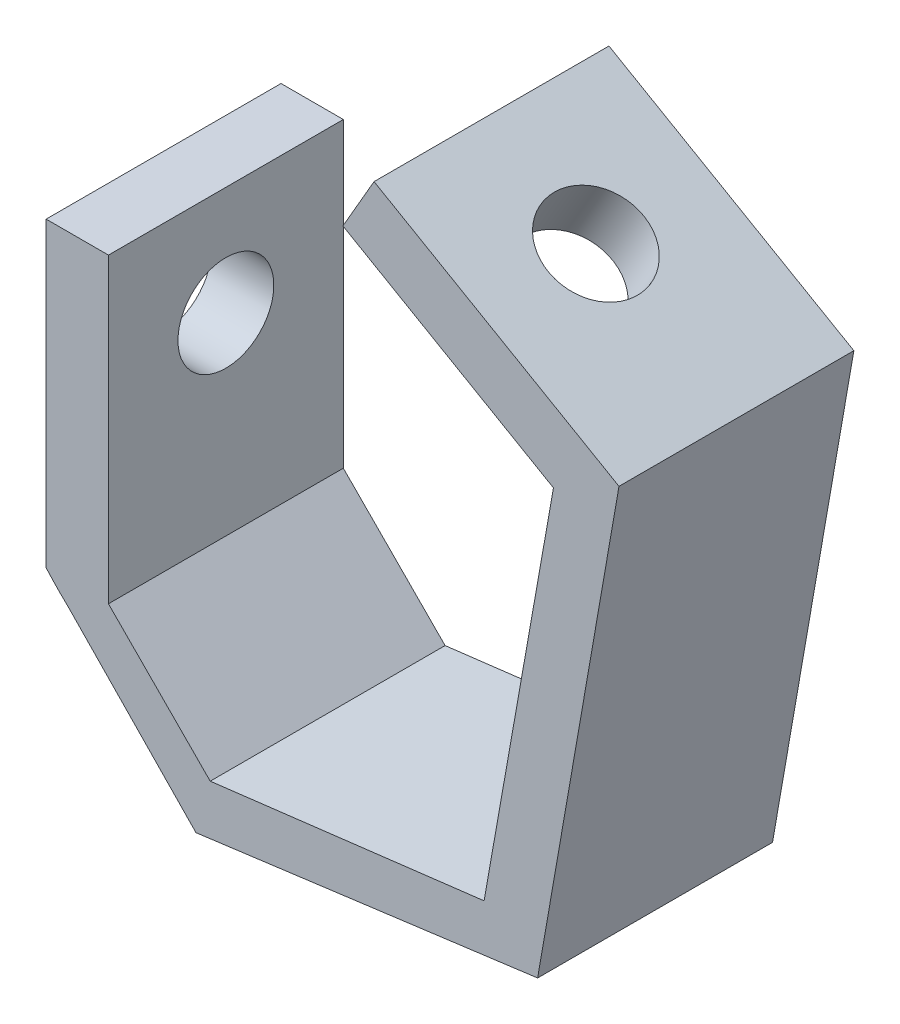
ISO-10303-21;
HEADER;
FILE_DESCRIPTION(('STEP AP214'),'2;1');
FILE_NAME('part.step','',(''),(''),'','','');
FILE_SCHEMA(('AUTOMOTIVE_DESIGN { 1 0 10303 214 1 1 1 1 }'));
ENDSEC;
DATA;
#1=APPLICATION_CONTEXT('core data for automotive mechanical design processes');
#2=APPLICATION_PROTOCOL_DEFINITION('international standard','automotive_design',2000,#1);
#3=PRODUCT_CONTEXT('',#1,'mechanical');
#4=PRODUCT('Part','Part','',(#3));
#5=PRODUCT_RELATED_PRODUCT_CATEGORY('part','',(#4));
#6=PRODUCT_DEFINITION_FORMATION('','',#4);
#7=PRODUCT_DEFINITION_CONTEXT('part definition',#1,'design');
#8=PRODUCT_DEFINITION('design','',#6,#7);
#9=PRODUCT_DEFINITION_SHAPE('','',#8);
#10=(LENGTH_UNIT() NAMED_UNIT(*) SI_UNIT(.MILLI.,.METRE.));
#11=(NAMED_UNIT(*) PLANE_ANGLE_UNIT() SI_UNIT($,.RADIAN.));
#12=(NAMED_UNIT(*) SI_UNIT($,.STERADIAN.) SOLID_ANGLE_UNIT());
#13=UNCERTAINTY_MEASURE_WITH_UNIT(LENGTH_MEASURE(1.E-05),#10,'distance_accuracy_value','');
#14=(GEOMETRIC_REPRESENTATION_CONTEXT(3) GLOBAL_UNCERTAINTY_ASSIGNED_CONTEXT((#13)) GLOBAL_UNIT_ASSIGNED_CONTEXT((#10,
#11,#12)) REPRESENTATION_CONTEXT('',''));
#15=CARTESIAN_POINT('',(0.,0.,0.));
#16=DIRECTION('',(0.,0.,1.));
#17=DIRECTION('',(1.,0.,0.));
#18=AXIS2_PLACEMENT_3D('',#15,#16,#17);
#19=CARTESIAN_POINT('',(3.62139958278742,-29.7599826456849,-284.));
#20=DIRECTION('',(0.120795817451497,-0.992677374823374,0.));
#21=DIRECTION('',(0.992677374823374,0.120795817451497,0.));
#22=AXIS2_PLACEMENT_3D('',#19,#20,#21);
#23=PLANE('',#22);
#24=DIRECTION('',(0.992677374823374,0.120795817451497,0.));
#25=VECTOR('',#24,1.);
#26=CARTESIAN_POINT('',(3.62139958278742,-29.7599826456849,0.));
#27=LINE('',#26,#25);
#28=CARTESIAN_POINT('',(-34.7689106346283,-34.4315799063301,0.));
#29=VERTEX_POINT('',#28);
#30=CARTESIAN_POINT('',(22.3631271349745,-27.4793602022425,0.));
#31=VERTEX_POINT('',#30);
#32=EDGE_CURVE('E164',#29,#31,#27,.T.);
#33=ORIENTED_EDGE('',*,*,#32,.F.);
#34=DIRECTION('',(0.,0.,-1.));
#35=VECTOR('',#34,1.);
#36=CARTESIAN_POINT('',(-34.7689106346283,-34.4315799063301,284.));
#37=LINE('',#36,#35);
#38=CARTESIAN_POINT('',(-34.7689106346283,-34.4315799063301,49.));
#39=VERTEX_POINT('',#38);
#40=EDGE_CURVE('E191',#39,#29,#37,.T.);
#41=ORIENTED_EDGE('',*,*,#40,.F.);
#42=DIRECTION('',(-0.992677374823374,-0.120795817451497,0.));
#43=VECTOR('',#42,1.);
#44=CARTESIAN_POINT('',(3.62139958278741,-29.7599826456849,49.));
#45=LINE('',#44,#43);
#46=CARTESIAN_POINT('',(22.3631271349745,-27.4793602022425,49.));
#47=VERTEX_POINT('',#46);
#48=EDGE_CURVE('E195',#47,#39,#45,.T.);
#49=ORIENTED_EDGE('',*,*,#48,.F.);
#50=DIRECTION('',(0.,0.,1.));
#51=VECTOR('',#50,1.);
#52=CARTESIAN_POINT('',(22.3631271349745,-27.4793602022425,-284.));
#53=LINE('',#52,#51);
#54=EDGE_CURVE('E163',#31,#47,#53,.T.);
#55=ORIENTED_EDGE('',*,*,#54,.F.);
#56=EDGE_LOOP('',(#33,#41,#49,#55));
#57=FACE_BOUND('',#56,.T.);
#58=ADVANCED_FACE('F42',(#57),#23,.F.);
#59=CARTESIAN_POINT('',(26.3980561235689,-4.66970064217994,-284.));
#60=DIRECTION('',(0.984711846020968,-0.174191217648818,0.));
#61=DIRECTION('',(0.174191217648818,0.984711846020968,0.));
#62=AXIS2_PLACEMENT_3D('',#59,#60,#61);
#63=PLANE('',#62);
#64=DIRECTION('',(0.174191217648818,0.984711846020968,0.));
#65=VECTOR('',#64,1.);
#66=CARTESIAN_POINT('',(26.3980561235689,-4.66970064217994,0.));
#67=LINE('',#66,#65);
#68=CARTESIAN_POINT('',(36.8406677231111,54.3629158367772,0.));
#69=VERTEX_POINT('',#68);
#70=EDGE_CURVE('E176',#31,#69,#67,.T.);
#71=ORIENTED_EDGE('',*,*,#70,.F.);
#72=ORIENTED_EDGE('',*,*,#54,.T.);
#73=DIRECTION('',(-0.174191217648818,-0.984711846020968,0.));
#74=VECTOR('',#73,1.);
#75=CARTESIAN_POINT('',(26.3980561235689,-4.66970064217994,49.));
#76=LINE('',#75,#74);
#77=CARTESIAN_POINT('',(36.8406677231111,54.3629158367772,49.));
#78=VERTEX_POINT('',#77);
#79=EDGE_CURVE('E151',#78,#47,#76,.T.);
#80=ORIENTED_EDGE('',*,*,#79,.F.);
#81=DIRECTION('',(0.,0.,1.));
#82=VECTOR('',#81,1.);
#83=CARTESIAN_POINT('',(36.8406677231111,54.3629158367772,-24.));
#84=LINE('',#83,#82);
#85=EDGE_CURVE('E161',#69,#78,#84,.T.);
#86=ORIENTED_EDGE('',*,*,#85,.F.);
#87=EDGE_LOOP('',(#71,#72,#80,#86));
#88=FACE_BOUND('',#87,.T.);
#89=ADVANCED_FACE('F160',(#88),#63,.F.);
#90=CARTESIAN_POINT('',(38.6119590248385,-6.73358585158545,-284.));
#91=DIRECTION('',(0.985132132549683,-0.171798374317437,0.));
#92=DIRECTION('',(0.171798374317437,0.985132132549683,0.));
#93=AXIS2_PLACEMENT_3D('',#90,#91,#92);
#94=PLANE('',#93);
#95=DIRECTION('',(0.,0.,1.));
#96=VECTOR('',#95,1.);
#97=CARTESIAN_POINT('',(33.535950770208,-35.8406065471613,-284.));
#98=LINE('',#97,#96);
#99=CARTESIAN_POINT('',(33.535950770208,-35.8406065471613,0.));
#100=VERTEX_POINT('',#99);
#101=CARTESIAN_POINT('',(33.535950770208,-35.8406065471613,49.));
#102=VERTEX_POINT('',#101);
#103=EDGE_CURVE('E205',#100,#102,#98,.T.);
#104=ORIENTED_EDGE('',*,*,#103,.F.);
#105=DIRECTION('',(0.171798374317437,0.985132132549683,0.));
#106=VECTOR('',#105,1.);
#107=CARTESIAN_POINT('',(37.4133421031573,-13.606736129388,0.));
#108=LINE('',#107,#106);
#109=CARTESIAN_POINT('',(50.5083302491978,61.4829941970784,0.));
#110=VERTEX_POINT('',#109);
#111=EDGE_CURVE('E187',#100,#110,#108,.T.);
#112=ORIENTED_EDGE('',*,*,#111,.T.);
#113=DIRECTION('',(0.,0.,-1.));
#114=VECTOR('',#113,1.);
#115=CARTESIAN_POINT('',(50.5083302491978,61.4829941970784,49.));
#116=LINE('',#115,#114);
#117=CARTESIAN_POINT('',(50.5083302491978,61.4829941970784,49.));
#118=VERTEX_POINT('',#117);
#119=EDGE_CURVE('E228',#118,#110,#116,.T.);
#120=ORIENTED_EDGE('',*,*,#119,.F.);
#121=DIRECTION('',(-0.171798374317437,-0.985132132549683,0.));
#122=VECTOR('',#121,1.);
#123=CARTESIAN_POINT('',(38.6119590248385,-6.73358585158544,49.));
#124=LINE('',#123,#122);
#125=EDGE_CURVE('E200',#118,#102,#124,.T.);
#126=ORIENTED_EDGE('',*,*,#125,.T.);
#127=EDGE_LOOP('',(#104,#112,#120,#126));
#128=FACE_BOUND('',#127,.T.);
#129=ADVANCED_FACE('F285',(#128),#94,.T.);
#130=CARTESIAN_POINT('',(5.21023157686451,-39.5702646129378,-284.));
#131=DIRECTION('',(0.130543614567205,-0.991442567522562,0.));
#132=DIRECTION('',(0.991442567522562,0.130543614567205,0.));
#133=AXIS2_PLACEMENT_3D('',#130,#131,#132);
#134=PLANE('',#133);
#135=DIRECTION('',(0.,0.,1.));
#136=VECTOR('',#135,1.);
#137=CARTESIAN_POINT('',(-37.7388538397128,-45.2253867917705,-284.));
#138=LINE('',#137,#136);
#139=CARTESIAN_POINT('',(-37.7388538397128,-45.2253867917705,0.));
#140=VERTEX_POINT('',#139);
#141=CARTESIAN_POINT('',(-37.7388538397128,-45.2253867917705,49.));
#142=VERTEX_POINT('',#141);
#143=EDGE_CURVE('E202',#140,#142,#138,.T.);
#144=ORIENTED_EDGE('',*,*,#143,.F.);
#145=DIRECTION('',(0.991442567522562,0.130543614567205,0.));
#146=VECTOR('',#145,1.);
#147=CARTESIAN_POINT('',(5.21023157686451,-39.5702646129378,0.));
#148=LINE('',#147,#146);
#149=EDGE_CURVE('E181',#140,#100,#148,.T.);
#150=ORIENTED_EDGE('',*,*,#149,.T.);
#151=ORIENTED_EDGE('',*,*,#103,.T.);
#152=DIRECTION('',(-0.991442567522562,-0.130543614567205,0.));
#153=VECTOR('',#152,1.);
#154=CARTESIAN_POINT('',(5.21023157686451,-39.5702646129378,49.));
#155=LINE('',#154,#153);
#156=EDGE_CURVE('E165',#102,#142,#155,.T.);
#157=ORIENTED_EDGE('',*,*,#156,.T.);
#158=EDGE_LOOP('',(#144,#150,#151,#157));
#159=FACE_BOUND('',#158,.T.);
#160=ADVANCED_FACE('F282',(#159),#134,.T.);
#161=CARTESIAN_POINT('',(-42.0447399681987,-40.7866869034071,-284.));
#162=DIRECTION('',(-0.717763617184966,-0.696286858877542,0.));
#163=DIRECTION('',(0.696286858877542,-0.717763617184966,0.));
#164=AXIS2_PLACEMENT_3D('',#161,#162,#163);
#165=PLANE('',#164);
#166=DIRECTION('',(0.,0.,-1.));
#167=VECTOR('',#166,1.);
#168=CARTESIAN_POINT('',(-64.4354967725427,-17.7052939538077,154.));
#169=LINE('',#168,#167);
#170=CARTESIAN_POINT('',(-64.4354967725427,-17.7052939538077,49.));
#171=VERTEX_POINT('',#170);
#172=CARTESIAN_POINT('',(-64.4354967725427,-17.7052939538077,0.));
#173=VERTEX_POINT('',#172);
#174=EDGE_CURVE('E184',#171,#173,#169,.T.);
#175=ORIENTED_EDGE('',*,*,#174,.T.);
#176=DIRECTION('',(0.696286858877542,-0.717763617184966,0.));
#177=VECTOR('',#176,1.);
#178=CARTESIAN_POINT('',(-42.0447399681987,-40.7866869034071,0.));
#179=LINE('',#178,#177);
#180=EDGE_CURVE('E178',#173,#140,#179,.T.);
#181=ORIENTED_EDGE('',*,*,#180,.T.);
#182=ORIENTED_EDGE('',*,*,#143,.T.);
#183=DIRECTION('',(-0.696286858877542,0.717763617184966,0.));
#184=VECTOR('',#183,1.);
#185=CARTESIAN_POINT('',(-42.0447399681987,-40.7866869034071,49.));
#186=LINE('',#185,#184);
#187=EDGE_CURVE('E169',#142,#171,#186,.T.);
#188=ORIENTED_EDGE('',*,*,#187,.T.);
#189=EDGE_LOOP('',(#175,#181,#182,#188));
#190=FACE_BOUND('',#189,.T.);
#191=ADVANCED_FACE('F278',(#190),#165,.T.);
#192=CARTESIAN_POINT('',(-15.5218442790721,34.311385031299,-9.00000000000001));
#193=DIRECTION('',(0.,0.,1.));
#194=DIRECTION('',(1.,0.,0.));
#195=AXIS2_PLACEMENT_3D('',#192,#193,#194);
#196=CYLINDRICAL_SURFACE('',#195,71.4022429121918);
#197=CARTESIAN_POINT('',(-15.5218442790721,34.311385031299,0.));
#198=DIRECTION('',(0.,0.,1.));
#199=DIRECTION('',(1.,0.,0.));
#200=AXIS2_PLACEMENT_3D('',#197,#198,#199);
#201=CIRCLE('',#200,71.4022429121918);
#202=CARTESIAN_POINT('',(-69.,-13.,0.));
#203=VERTEX_POINT('',#202);
#204=EDGE_CURVE('E209',#173,#203,#201,.F.);
#205=ORIENTED_EDGE('',*,*,#204,.F.);
#206=ORIENTED_EDGE('',*,*,#174,.F.);
#207=CARTESIAN_POINT('',(-15.5218442790721,34.311385031299,49.));
#208=DIRECTION('',(0.,0.,1.));
#209=DIRECTION('',(1.,0.,0.));
#210=AXIS2_PLACEMENT_3D('',#207,#208,#209);
#211=CIRCLE('',#210,71.4022429121918);
#212=CARTESIAN_POINT('',(-69.,-13.,49.));
#213=VERTEX_POINT('',#212);
#214=EDGE_CURVE('E211',#213,#171,#211,.T.);
#215=ORIENTED_EDGE('',*,*,#214,.F.);
#216=DIRECTION('',(0.,0.,-1.));
#217=VECTOR('',#216,1.);
#218=CARTESIAN_POINT('',(-69.,-13.,49.));
#219=LINE('',#218,#217);
#220=EDGE_CURVE('E242',#213,#203,#219,.T.);
#221=ORIENTED_EDGE('',*,*,#220,.T.);
#222=EDGE_LOOP('',(#205,#206,#215,#221));
#223=FACE_BOUND('',#222,.T.);
#224=ADVANCED_FACE('F276',(#223),#196,.T.);
#225=CARTESIAN_POINT('',(39.25,67.9829941970784,49.));
#226=DIRECTION('',(-0.5,-0.866025403784438,0.));
#227=DIRECTION('',(0.866025403784439,-0.5,0.));
#228=AXIS2_PLACEMENT_3D('',#225,#226,#227);
#229=PLANE('',#228);
#230=DIRECTION('',(-0.866025403784438,0.5,0.));
#231=VECTOR('',#230,1.);
#232=CARTESIAN_POINT('',(39.25,67.9829941970784,0.));
#233=LINE('',#232,#231);
#234=CARTESIAN_POINT('',(-0.587168574084113,90.9829941970784,0.));
#235=VERTEX_POINT('',#234);
#236=EDGE_CURVE('E218',#110,#235,#233,.T.);
#237=ORIENTED_EDGE('',*,*,#236,.T.);
#238=DIRECTION('',(0.,0.,-1.));
#239=VECTOR('',#238,1.);
#240=CARTESIAN_POINT('',(-0.587168574084113,90.9829941970784,49.));
#241=LINE('',#240,#239);
#242=CARTESIAN_POINT('',(-0.587168574084113,90.9829941970784,49.));
#243=VERTEX_POINT('',#242);
#244=EDGE_CURVE('E251',#243,#235,#241,.T.);
#245=ORIENTED_EDGE('',*,*,#244,.F.);
#246=DIRECTION('',(-0.866025403784438,0.5,0.));
#247=VECTOR('',#246,1.);
#248=CARTESIAN_POINT('',(39.25,67.9829941970784,49.));
#249=LINE('',#248,#247);
#250=EDGE_CURVE('E93',#118,#243,#249,.T.);
#251=ORIENTED_EDGE('',*,*,#250,.F.);
#252=ORIENTED_EDGE('',*,*,#119,.T.);
#253=EDGE_LOOP('',(#237,#245,#251,#252));
#254=FACE_BOUND('',#253,.T.);
#255=CARTESIAN_POINT('',(21.1933703310945,78.4079941970784,24.5));
#256=DIRECTION('',(0.5,0.866025403784439,0.));
#257=DIRECTION('',(-0.866025403784439,0.5,0.));
#258=AXIS2_PLACEMENT_3D('',#255,#256,#257);
#259=CIRCLE('',#258,9.99999999999999);
#260=CARTESIAN_POINT('',(12.5331162932501,83.4079941970784,24.5));
#261=VERTEX_POINT('',#260);
#262=EDGE_CURVE('E214',#261,#261,#259,.T.);
#263=ORIENTED_EDGE('',*,*,#262,.F.);
#264=EDGE_LOOP('',(#263));
#265=FACE_BOUND('',#264,.T.);
#266=ADVANCED_FACE('F44',(#254,#265),#229,.F.);
#267=CARTESIAN_POINT('',(-39.8371685740841,23.,49.));
#268=DIRECTION('',(-0.866025403784438,0.5,0.));
#269=DIRECTION('',(-0.5,-0.866025403784439,0.));
#270=AXIS2_PLACEMENT_3D('',#267,#268,#269);
#271=PLANE('',#270);
#272=DIRECTION('',(0.5,0.866025403784438,0.));
#273=VECTOR('',#272,1.);
#274=CARTESIAN_POINT('',(-39.8371685740841,23.,0.));
#275=LINE('',#274,#273);
#276=CARTESIAN_POINT('',(-7.08716857408409,79.7246639478807,0.));
#277=VERTEX_POINT('',#276);
#278=EDGE_CURVE('E231',#277,#235,#275,.T.);
#279=ORIENTED_EDGE('',*,*,#278,.F.);
#280=DIRECTION('',(0.,0.,-1.));
#281=VECTOR('',#280,1.);
#282=CARTESIAN_POINT('',(-7.08716857408409,79.7246639478807,49.));
#283=LINE('',#282,#281);
#284=CARTESIAN_POINT('',(-7.08716857408409,79.7246639478807,49.));
#285=VERTEX_POINT('',#284);
#286=EDGE_CURVE('E249',#285,#277,#283,.T.);
#287=ORIENTED_EDGE('',*,*,#286,.F.);
#288=DIRECTION('',(0.5,0.866025403784438,0.));
#289=VECTOR('',#288,1.);
#290=CARTESIAN_POINT('',(-39.8371685740841,23.,49.));
#291=LINE('',#290,#289);
#292=EDGE_CURVE('E154',#285,#243,#291,.T.);
#293=ORIENTED_EDGE('',*,*,#292,.T.);
#294=ORIENTED_EDGE('',*,*,#244,.T.);
#295=EDGE_LOOP('',(#279,#287,#293,#294));
#296=FACE_BOUND('',#295,.T.);
#297=ADVANCED_FACE('F291',(#296),#271,.T.);
#298=CARTESIAN_POINT('',(32.7499999999998,56.7246639478808,49.));
#299=DIRECTION('',(-0.499999999999998,-0.86602540378444,0.));
#300=DIRECTION('',(0.86602540378444,-0.499999999999998,0.));
#301=AXIS2_PLACEMENT_3D('',#298,#299,#300);
#302=PLANE('',#301);
#303=DIRECTION('',(-0.86602540378444,0.499999999999998,0.));
#304=VECTOR('',#303,1.);
#305=CARTESIAN_POINT('',(32.7499999999998,56.7246639478808,0.));
#306=LINE('',#305,#304);
#307=EDGE_CURVE('E57',#69,#277,#306,.T.);
#308=ORIENTED_EDGE('',*,*,#307,.F.);
#309=ORIENTED_EDGE('',*,*,#85,.T.);
#310=DIRECTION('',(-0.86602540378444,0.499999999999998,0.));
#311=VECTOR('',#310,1.);
#312=CARTESIAN_POINT('',(32.7499999999998,56.7246639478808,49.));
#313=LINE('',#312,#311);
#314=EDGE_CURVE('E147',#78,#285,#313,.T.);
#315=ORIENTED_EDGE('',*,*,#314,.T.);
#316=ORIENTED_EDGE('',*,*,#286,.T.);
#317=EDGE_LOOP('',(#308,#309,#315,#316));
#318=FACE_BOUND('',#317,.T.);
#319=CARTESIAN_POINT('',(14.6933703310945,67.1496639478807,24.5));
#320=DIRECTION('',(0.5,0.866025403784439,0.));
#321=DIRECTION('',(-0.866025403784439,0.5,0.));
#322=AXIS2_PLACEMENT_3D('',#319,#320,#321);
#323=CIRCLE('',#322,9.99999999999999);
#324=CARTESIAN_POINT('',(6.03311629325014,72.1496639478807,24.5));
#325=VERTEX_POINT('',#324);
#326=EDGE_CURVE('E215',#325,#325,#323,.T.);
#327=ORIENTED_EDGE('',*,*,#326,.T.);
#328=EDGE_LOOP('',(#327));
#329=FACE_BOUND('',#328,.T.);
#330=ADVANCED_FACE('F167',(#318,#329),#302,.T.);
#331=CARTESIAN_POINT('',(-56.,0.,49.));
#332=DIRECTION('',(-1.,0.,0.));
#333=DIRECTION('',(0.,0.,1.));
#334=AXIS2_PLACEMENT_3D('',#331,#332,#333);
#335=PLANE('',#334);
#336=CARTESIAN_POINT('',(-56.,27.31,24.5));
#337=DIRECTION('',(-1.,0.,0.));
#338=DIRECTION('',(0.,0.,1.));
#339=AXIS2_PLACEMENT_3D('',#336,#337,#338);
#340=CIRCLE('',#339,10.);
#341=CARTESIAN_POINT('',(-56.,27.31,34.5));
#342=VERTEX_POINT('',#341);
#343=EDGE_CURVE('E50',#342,#342,#340,.F.);
#344=ORIENTED_EDGE('',*,*,#343,.F.);
#345=EDGE_LOOP('',(#344));
#346=FACE_BOUND('',#345,.T.);
#347=DIRECTION('',(0.,0.,-1.));
#348=VECTOR('',#347,1.);
#349=CARTESIAN_POINT('',(-56.,50.,49.));
#350=LINE('',#349,#348);
#351=CARTESIAN_POINT('',(-56.,50.,49.));
#352=VERTEX_POINT('',#351);
#353=CARTESIAN_POINT('',(-56.,50.,0.));
#354=VERTEX_POINT('',#353);
#355=EDGE_CURVE('E247',#352,#354,#350,.T.);
#356=ORIENTED_EDGE('',*,*,#355,.F.);
#357=DIRECTION('',(0.,1.,0.));
#358=VECTOR('',#357,1.);
#359=CARTESIAN_POINT('',(-56.,0.,49.));
#360=LINE('',#359,#358);
#361=CARTESIAN_POINT('',(-56.,-13.,49.));
#362=VERTEX_POINT('',#361);
#363=EDGE_CURVE('E155',#362,#352,#360,.T.);
#364=ORIENTED_EDGE('',*,*,#363,.F.);
#365=DIRECTION('',(0.,0.,-1.));
#366=VECTOR('',#365,1.);
#367=CARTESIAN_POINT('',(-56.,-13.,284.));
#368=LINE('',#367,#366);
#369=CARTESIAN_POINT('',(-56.,-13.,0.));
#370=VERTEX_POINT('',#369);
#371=EDGE_CURVE('E192',#362,#370,#368,.T.);
#372=ORIENTED_EDGE('',*,*,#371,.T.);
#373=DIRECTION('',(0.,1.,0.));
#374=VECTOR('',#373,1.);
#375=CARTESIAN_POINT('',(-56.,0.,0.));
#376=LINE('',#375,#374);
#377=EDGE_CURVE('E235',#370,#354,#376,.T.);
#378=ORIENTED_EDGE('',*,*,#377,.T.);
#379=EDGE_LOOP('',(#356,#364,#372,#378));
#380=FACE_BOUND('',#379,.T.);
#381=ADVANCED_FACE('F260',(#346,#380),#335,.F.);
#382=CARTESIAN_POINT('',(0.,50.,49.));
#383=DIRECTION('',(0.,-1.,0.));
#384=DIRECTION('',(0.,0.,-1.));
#385=AXIS2_PLACEMENT_3D('',#382,#383,#384);
#386=PLANE('',#385);
#387=DIRECTION('',(-1.,0.,0.));
#388=VECTOR('',#387,1.);
#389=CARTESIAN_POINT('',(0.,50.,0.));
#390=LINE('',#389,#388);
#391=CARTESIAN_POINT('',(-69.,50.,0.));
#392=VERTEX_POINT('',#391);
#393=EDGE_CURVE('E86',#354,#392,#390,.T.);
#394=ORIENTED_EDGE('',*,*,#393,.T.);
#395=DIRECTION('',(0.,0.,-1.));
#396=VECTOR('',#395,1.);
#397=CARTESIAN_POINT('',(-69.,50.,49.));
#398=LINE('',#397,#396);
#399=CARTESIAN_POINT('',(-69.,50.,49.));
#400=VERTEX_POINT('',#399);
#401=EDGE_CURVE('E245',#400,#392,#398,.T.);
#402=ORIENTED_EDGE('',*,*,#401,.F.);
#403=DIRECTION('',(-1.,0.,0.));
#404=VECTOR('',#403,1.);
#405=CARTESIAN_POINT('',(0.,50.,49.));
#406=LINE('',#405,#404);
#407=EDGE_CURVE('E66',#352,#400,#406,.T.);
#408=ORIENTED_EDGE('',*,*,#407,.F.);
#409=ORIENTED_EDGE('',*,*,#355,.T.);
#410=EDGE_LOOP('',(#394,#402,#408,#409));
#411=FACE_BOUND('',#410,.T.);
#412=ADVANCED_FACE('F263',(#411),#386,.F.);
#413=CARTESIAN_POINT('',(-69.,0.,49.));
#414=DIRECTION('',(1.,0.,0.));
#415=DIRECTION('',(0.,0.,-1.));
#416=AXIS2_PLACEMENT_3D('',#413,#414,#415);
#417=PLANE('',#416);
#418=CARTESIAN_POINT('',(-69.,27.31,24.5));
#419=DIRECTION('',(1.,0.,0.));
#420=DIRECTION('',(0.,0.,-1.));
#421=AXIS2_PLACEMENT_3D('',#418,#419,#420);
#422=CIRCLE('',#421,10.);
#423=CARTESIAN_POINT('',(-69.,27.31,14.5));
#424=VERTEX_POINT('',#423);
#425=EDGE_CURVE('E253',#424,#424,#422,.F.);
#426=ORIENTED_EDGE('',*,*,#425,.F.);
#427=EDGE_LOOP('',(#426));
#428=FACE_BOUND('',#427,.T.);
#429=ORIENTED_EDGE('',*,*,#220,.F.);
#430=DIRECTION('',(0.,-1.,0.));
#431=VECTOR('',#430,1.);
#432=CARTESIAN_POINT('',(-69.,0.,49.));
#433=LINE('',#432,#431);
#434=EDGE_CURVE('E226',#400,#213,#433,.T.);
#435=ORIENTED_EDGE('',*,*,#434,.F.);
#436=ORIENTED_EDGE('',*,*,#401,.T.);
#437=DIRECTION('',(0.,-1.,0.));
#438=VECTOR('',#437,1.);
#439=CARTESIAN_POINT('',(-69.,0.,0.));
#440=LINE('',#439,#438);
#441=EDGE_CURVE('E222',#392,#203,#440,.T.);
#442=ORIENTED_EDGE('',*,*,#441,.T.);
#443=EDGE_LOOP('',(#429,#435,#436,#442));
#444=FACE_BOUND('',#443,.T.);
#445=ADVANCED_FACE('F271',(#428,#444),#417,.F.);
#446=CARTESIAN_POINT('',(0.,0.,49.));
#447=DIRECTION('',(0.,0.,1.));
#448=DIRECTION('',(1.,0.,0.));
#449=AXIS2_PLACEMENT_3D('',#446,#447,#448);
#450=PLANE('',#449);
#451=ORIENTED_EDGE('',*,*,#314,.F.);
#452=ORIENTED_EDGE('',*,*,#79,.T.);
#453=ORIENTED_EDGE('',*,*,#48,.T.);
#454=DIRECTION('',(-0.703776005874306,0.710421940508322,0.));
#455=VECTOR('',#454,1.);
#456=CARTESIAN_POINT('',(-34.7628755842076,-34.4376719472566,49.));
#457=LINE('',#456,#455);
#458=EDGE_CURVE('E11',#39,#362,#457,.T.);
#459=ORIENTED_EDGE('',*,*,#458,.T.);
#460=ORIENTED_EDGE('',*,*,#363,.T.);
#461=ORIENTED_EDGE('',*,*,#407,.T.);
#462=ORIENTED_EDGE('',*,*,#434,.T.);
#463=ORIENTED_EDGE('',*,*,#214,.T.);
#464=ORIENTED_EDGE('',*,*,#187,.F.);
#465=ORIENTED_EDGE('',*,*,#156,.F.);
#466=ORIENTED_EDGE('',*,*,#125,.F.);
#467=ORIENTED_EDGE('',*,*,#250,.T.);
#468=ORIENTED_EDGE('',*,*,#292,.F.);
#469=EDGE_LOOP('',(#451,#452,#453,#459,#460,#461,#462,#463,#464,#465,#466,#467,#468));
#470=FACE_BOUND('',#469,.T.);
#471=ADVANCED_FACE('F149',(#470),#450,.T.);
#472=CARTESIAN_POINT('',(0.,0.,0.));
#473=DIRECTION('',(0.,0.,1.));
#474=DIRECTION('',(1.,0.,0.));
#475=AXIS2_PLACEMENT_3D('',#472,#473,#474);
#476=PLANE('',#475);
#477=ORIENTED_EDGE('',*,*,#70,.T.);
#478=ORIENTED_EDGE('',*,*,#307,.T.);
#479=ORIENTED_EDGE('',*,*,#278,.T.);
#480=ORIENTED_EDGE('',*,*,#236,.F.);
#481=ORIENTED_EDGE('',*,*,#111,.F.);
#482=ORIENTED_EDGE('',*,*,#149,.F.);
#483=ORIENTED_EDGE('',*,*,#180,.F.);
#484=ORIENTED_EDGE('',*,*,#204,.T.);
#485=ORIENTED_EDGE('',*,*,#441,.F.);
#486=ORIENTED_EDGE('',*,*,#393,.F.);
#487=ORIENTED_EDGE('',*,*,#377,.F.);
#488=DIRECTION('',(0.703776005874306,-0.710421940508322,0.));
#489=VECTOR('',#488,1.);
#490=CARTESIAN_POINT('',(-34.7628755842076,-34.4376719472566,0.));
#491=LINE('',#490,#489);
#492=EDGE_CURVE('E188',#370,#29,#491,.T.);
#493=ORIENTED_EDGE('',*,*,#492,.T.);
#494=ORIENTED_EDGE('',*,*,#32,.T.);
#495=EDGE_LOOP('',(#477,#478,#479,#480,#481,#482,#483,#484,#485,#486,#487,#493,#494));
#496=FACE_BOUND('',#495,.T.);
#497=ADVANCED_FACE('F293',(#496),#476,.F.);
#498=CARTESIAN_POINT('',(14.6933703310945,67.1496639478807,24.5));
#499=DIRECTION('',(0.5,0.866025403784438,0.));
#500=DIRECTION('',(-0.866025403784438,0.5,0.));
#501=AXIS2_PLACEMENT_3D('',#498,#499,#500);
#502=CYLINDRICAL_SURFACE('',#501,9.99999999999999);
#503=ORIENTED_EDGE('',*,*,#326,.F.);
#504=EDGE_LOOP('',(#503));
#505=FACE_BOUND('',#504,.T.);
#506=ORIENTED_EDGE('',*,*,#262,.T.);
#507=EDGE_LOOP('',(#506));
#508=FACE_BOUND('',#507,.T.);
#509=ADVANCED_FACE('F304',(#505,#508),#502,.F.);
#510=CARTESIAN_POINT('',(-49.,27.31,24.5));
#511=DIRECTION('',(-1.,0.,0.));
#512=DIRECTION('',(0.,0.,1.));
#513=AXIS2_PLACEMENT_3D('',#510,#511,#512);
#514=CYLINDRICAL_SURFACE('',#513,10.);
#515=ORIENTED_EDGE('',*,*,#425,.T.);
#516=EDGE_LOOP('',(#515));
#517=FACE_BOUND('',#516,.T.);
#518=ORIENTED_EDGE('',*,*,#343,.T.);
#519=EDGE_LOOP('',(#518));
#520=FACE_BOUND('',#519,.T.);
#521=ADVANCED_FACE('F258',(#517,#520),#514,.F.);
#522=CARTESIAN_POINT('',(-34.7628755842076,-34.4376719472566,284.));
#523=DIRECTION('',(0.710421940508322,0.703776005874306,0.));
#524=DIRECTION('',(-0.703776005874306,0.710421940508322,0.));
#525=AXIS2_PLACEMENT_3D('',#522,#523,#524);
#526=PLANE('',#525);
#527=ORIENTED_EDGE('',*,*,#40,.T.);
#528=ORIENTED_EDGE('',*,*,#492,.F.);
#529=ORIENTED_EDGE('',*,*,#371,.F.);
#530=ORIENTED_EDGE('',*,*,#458,.F.);
#531=EDGE_LOOP('',(#527,#528,#529,#530));
#532=FACE_BOUND('',#531,.T.);
#533=ADVANCED_FACE('F297',(#532),#526,.T.);
#534=CLOSED_SHELL('',(#58,#89,#129,#160,#191,#224,#266,#297,#330,#381,#412,#445,#471,#497,#509,
#521,#533));
#535=MANIFOLD_SOLID_BREP('B2',#534);
#536=ADVANCED_BREP_SHAPE_REPRESENTATION('',(#18,#535),#14);
#537=SHAPE_DEFINITION_REPRESENTATION(#9,#536);
ENDSEC;
END-ISO-10303-21;
